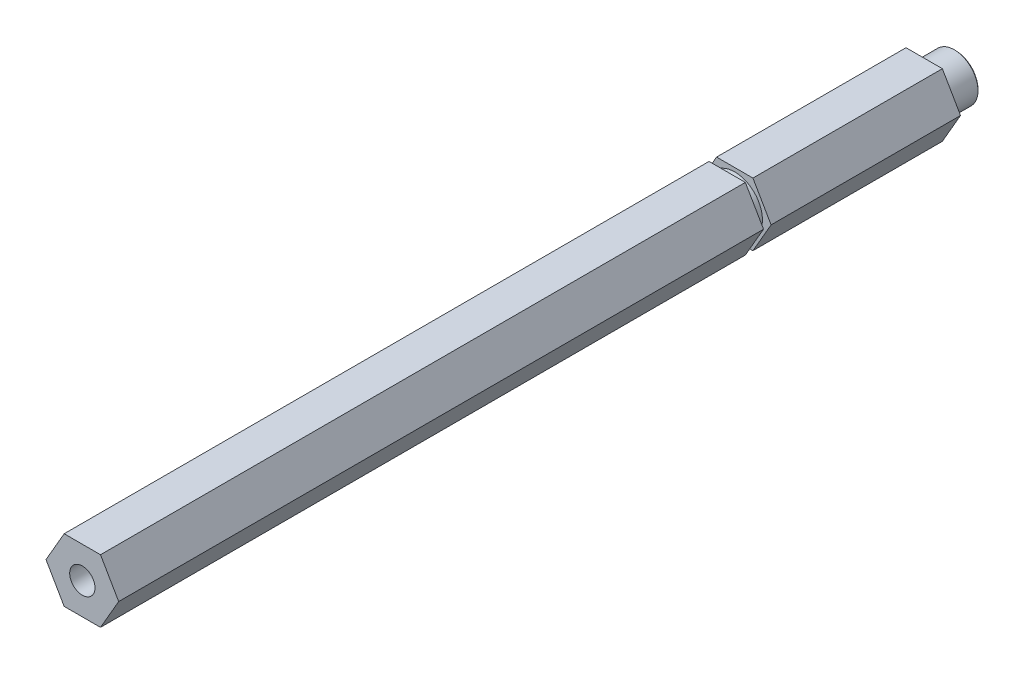
ISO-10303-21;
HEADER;
FILE_DESCRIPTION(('STEP AP214'),'2;1');
FILE_NAME('part.step','',(''),(''),'','','');
FILE_SCHEMA(('AUTOMOTIVE_DESIGN { 1 0 10303 214 1 1 1 1 }'));
ENDSEC;
DATA;
#1=APPLICATION_CONTEXT('core data for automotive mechanical design processes');
#2=APPLICATION_PROTOCOL_DEFINITION('international standard','automotive_design',2000,#1);
#3=PRODUCT_CONTEXT('',#1,'mechanical');
#4=PRODUCT('Part','Part','',(#3));
#5=PRODUCT_RELATED_PRODUCT_CATEGORY('part','',(#4));
#6=PRODUCT_DEFINITION_FORMATION('','',#4);
#7=PRODUCT_DEFINITION_CONTEXT('part definition',#1,'design');
#8=PRODUCT_DEFINITION('design','',#6,#7);
#9=PRODUCT_DEFINITION_SHAPE('','',#8);
#10=(LENGTH_UNIT() NAMED_UNIT(*) SI_UNIT(.MILLI.,.METRE.));
#11=(NAMED_UNIT(*) PLANE_ANGLE_UNIT() SI_UNIT($,.RADIAN.));
#12=(NAMED_UNIT(*) SI_UNIT($,.STERADIAN.) SOLID_ANGLE_UNIT());
#13=UNCERTAINTY_MEASURE_WITH_UNIT(LENGTH_MEASURE(1.E-05),#10,'distance_accuracy_value','');
#14=(GEOMETRIC_REPRESENTATION_CONTEXT(3) GLOBAL_UNCERTAINTY_ASSIGNED_CONTEXT((#13)) GLOBAL_UNIT_ASSIGNED_CONTEXT((#10,
#11,#12)) REPRESENTATION_CONTEXT('',''));
#15=CARTESIAN_POINT('',(0.,0.,0.));
#16=DIRECTION('',(0.,0.,1.));
#17=DIRECTION('',(1.,0.,0.));
#18=AXIS2_PLACEMENT_3D('',#15,#16,#17);
#19=CARTESIAN_POINT('',(0.,0.,11.176));
#20=DIRECTION('',(0.,0.,-1.));
#21=DIRECTION('',(-1.,0.,0.));
#22=AXIS2_PLACEMENT_3D('',#19,#20,#21);
#23=PLANE('',#22);
#24=CARTESIAN_POINT('',(0.,0.,11.176));
#25=DIRECTION('',(0.,0.,-1.));
#26=DIRECTION('',(-1.,0.,0.));
#27=AXIS2_PLACEMENT_3D('',#24,#25,#26);
#28=CIRCLE('',#27,3.175);
#29=CARTESIAN_POINT('',(-3.175,0.,11.176));
#30=VERTEX_POINT('',#29);
#31=EDGE_CURVE('E20',#30,#30,#28,.T.);
#32=ORIENTED_EDGE('',*,*,#31,.T.);
#33=EDGE_LOOP('',(#32));
#34=FACE_BOUND('',#33,.T.);
#35=ADVANCED_FACE('F17',(#34),#23,.T.);
#36=CARTESIAN_POINT('',(0.,0.,11.176));
#37=DIRECTION('',(0.,0.,-1.));
#38=DIRECTION('',(-1.,0.,0.));
#39=AXIS2_PLACEMENT_3D('',#36,#37,#38);
#40=CYLINDRICAL_SURFACE('',#39,3.175);
#41=CARTESIAN_POINT('',(0.,0.,0.253999999983989));
#42=DIRECTION('',(0.,0.,-1.));
#43=DIRECTION('',(-1.,0.,0.));
#44=AXIS2_PLACEMENT_3D('',#41,#42,#43);
#45=CIRCLE('',#44,3.17499999994197);
#46=CARTESIAN_POINT('',(-3.17499999994197,0.,0.253999999983989));
#47=VERTEX_POINT('',#46);
#48=EDGE_CURVE('E139',#47,#47,#45,.T.);
#49=ORIENTED_EDGE('',*,*,#48,.T.);
#50=EDGE_LOOP('',(#49));
#51=FACE_BOUND('',#50,.T.);
#52=ORIENTED_EDGE('',*,*,#31,.F.);
#53=EDGE_LOOP('',(#52));
#54=FACE_BOUND('',#53,.T.);
#55=ADVANCED_FACE('F401',(#51,#54),#40,.F.);
#56=CARTESIAN_POINT('',(0.,0.,1.13686837721616E-10));
#57=DIRECTION('',(0.,0.,-1.));
#58=DIRECTION('',(-1.,0.,0.));
#59=AXIS2_PLACEMENT_3D('',#56,#57,#58);
#60=CONICAL_SURFACE('',#59,3.42899999986912,0.785398163397448);
#61=CARTESIAN_POINT('',(0.,0.,0.));
#62=DIRECTION('',(0.,0.,-1.));
#63=DIRECTION('',(-1.,0.,0.));
#64=AXIS2_PLACEMENT_3D('',#61,#62,#63);
#65=CIRCLE('',#64,3.42899999998281);
#66=CARTESIAN_POINT('',(-3.42899999998281,0.,0.));
#67=VERTEX_POINT('',#66);
#68=EDGE_CURVE('E142',#67,#67,#65,.T.);
#69=ORIENTED_EDGE('',*,*,#68,.T.);
#70=EDGE_LOOP('',(#69));
#71=FACE_BOUND('',#70,.T.);
#72=ORIENTED_EDGE('',*,*,#48,.F.);
#73=EDGE_LOOP('',(#72));
#74=FACE_BOUND('',#73,.T.);
#75=ADVANCED_FACE('F163',(#71,#74),#60,.F.);
#76=CARTESIAN_POINT('',(0.,0.,0.));
#77=DIRECTION('',(0.,0.,1.));
#78=DIRECTION('',(1.,0.,0.));
#79=AXIS2_PLACEMENT_3D('',#76,#77,#78);
#80=PLANE('',#79);
#81=ORIENTED_EDGE('',*,*,#68,.F.);
#82=EDGE_LOOP('',(#81));
#83=FACE_BOUND('',#82,.T.);
#84=CARTESIAN_POINT('',(0.,0.,0.));
#85=DIRECTION('',(0.,0.,1.));
#86=DIRECTION('',(1.,0.,0.));
#87=AXIS2_PLACEMENT_3D('',#84,#85,#86);
#88=CIRCLE('',#87,4.50849999998582);
#89=CARTESIAN_POINT('',(4.50849999998582,0.,0.));
#90=VERTEX_POINT('',#89);
#91=EDGE_CURVE('E138',#90,#90,#88,.T.);
#92=ORIENTED_EDGE('',*,*,#91,.F.);
#93=EDGE_LOOP('',(#92));
#94=FACE_BOUND('',#93,.T.);
#95=ADVANCED_FACE('F166',(#83,#94),#80,.F.);
#96=CARTESIAN_POINT('',(0.,0.,0.253999999927146));
#97=DIRECTION('',(0.,0.,1.));
#98=DIRECTION('',(1.,0.,0.));
#99=AXIS2_PLACEMENT_3D('',#96,#97,#98);
#100=CONICAL_SURFACE('',#99,4.76249999991296,0.785398163397448);
#101=ORIENTED_EDGE('',*,*,#91,.T.);
#102=EDGE_LOOP('',(#101));
#103=FACE_BOUND('',#102,.T.);
#104=CARTESIAN_POINT('',(0.,0.,0.254000000000012));
#105=DIRECTION('',(0.,0.,-1.));
#106=DIRECTION('',(-1.,0.,0.));
#107=AXIS2_PLACEMENT_3D('',#104,#105,#106);
#108=CIRCLE('',#107,4.7625);
#109=CARTESIAN_POINT('',(-4.7625,0.,0.254000000000012));
#110=VERTEX_POINT('',#109);
#111=EDGE_CURVE('E135',#110,#110,#108,.F.);
#112=ORIENTED_EDGE('',*,*,#111,.F.);
#113=EDGE_LOOP('',(#112));
#114=FACE_BOUND('',#113,.T.);
#115=ADVANCED_FACE('F169',(#103,#114),#100,.T.);
#116=CARTESIAN_POINT('',(0.,0.,6.35));
#117=DIRECTION('',(0.,0.,-1.));
#118=DIRECTION('',(-1.,0.,0.));
#119=AXIS2_PLACEMENT_3D('',#116,#117,#118);
#120=CYLINDRICAL_SURFACE('',#119,4.7625);
#121=CARTESIAN_POINT('',(0.,0.,6.35));
#122=DIRECTION('',(0.,0.,-1.));
#123=DIRECTION('',(-1.,0.,0.));
#124=AXIS2_PLACEMENT_3D('',#121,#122,#123);
#125=CIRCLE('',#124,4.7625);
#126=CARTESIAN_POINT('',(-4.7625,0.,6.35));
#127=VERTEX_POINT('',#126);
#128=EDGE_CURVE('E117',#127,#127,#125,.T.);
#129=ORIENTED_EDGE('',*,*,#128,.T.);
#130=EDGE_LOOP('',(#129));
#131=FACE_BOUND('',#130,.T.);
#132=ORIENTED_EDGE('',*,*,#111,.T.);
#133=EDGE_LOOP('',(#132));
#134=FACE_BOUND('',#133,.T.);
#135=ADVANCED_FACE('F175',(#131,#134),#120,.T.);
#136=CARTESIAN_POINT('',(0.,0.,6.35));
#137=DIRECTION('',(0.,0.,1.));
#138=DIRECTION('',(1.,0.,0.));
#139=AXIS2_PLACEMENT_3D('',#136,#137,#138);
#140=PLANE('',#139);
#141=ORIENTED_EDGE('',*,*,#128,.F.);
#142=EDGE_LOOP('',(#141));
#143=FACE_BOUND('',#142,.T.);
#144=DIRECTION('',(-1.,0.,0.));
#145=VECTOR('',#144,1.);
#146=CARTESIAN_POINT('',(-3.66617420935412,-6.35,6.35));
#147=LINE('',#146,#145);
#148=CARTESIAN_POINT('',(3.66617420935412,-6.35,6.35));
#149=VERTEX_POINT('',#148);
#150=CARTESIAN_POINT('',(-3.66617420935412,-6.35,6.35));
#151=VERTEX_POINT('',#150);
#152=EDGE_CURVE('E481',#149,#151,#147,.T.);
#153=ORIENTED_EDGE('',*,*,#152,.T.);
#154=DIRECTION('',(-0.5,0.866025403784438,0.));
#155=VECTOR('',#154,1.);
#156=CARTESIAN_POINT('',(-7.33234841870825,0.,6.35));
#157=LINE('',#156,#155);
#158=CARTESIAN_POINT('',(-7.33234841870825,0.,6.35));
#159=VERTEX_POINT('',#158);
#160=EDGE_CURVE('E491',#151,#159,#157,.T.);
#161=ORIENTED_EDGE('',*,*,#160,.T.);
#162=DIRECTION('',(0.5,0.866025403784439,0.));
#163=VECTOR('',#162,1.);
#164=CARTESIAN_POINT('',(-3.66617420935412,6.35,6.35));
#165=LINE('',#164,#163);
#166=CARTESIAN_POINT('',(-3.66617420935412,6.35,6.35));
#167=VERTEX_POINT('',#166);
#168=EDGE_CURVE('E463',#159,#167,#165,.T.);
#169=ORIENTED_EDGE('',*,*,#168,.T.);
#170=DIRECTION('',(1.,0.,0.));
#171=VECTOR('',#170,1.);
#172=CARTESIAN_POINT('',(3.66617420935412,6.35,6.35));
#173=LINE('',#172,#171);
#174=CARTESIAN_POINT('',(3.66617420935412,6.35,6.35));
#175=VERTEX_POINT('',#174);
#176=EDGE_CURVE('E129',#167,#175,#173,.T.);
#177=ORIENTED_EDGE('',*,*,#176,.T.);
#178=DIRECTION('',(0.5,-0.866025403784439,0.));
#179=VECTOR('',#178,1.);
#180=CARTESIAN_POINT('',(7.33234841870825,0.,6.34999999999999));
#181=LINE('',#180,#179);
#182=CARTESIAN_POINT('',(7.33234841870825,0.,6.35));
#183=VERTEX_POINT('',#182);
#184=EDGE_CURVE('E122',#175,#183,#181,.T.);
#185=ORIENTED_EDGE('',*,*,#184,.T.);
#186=DIRECTION('',(-0.5,-0.866025403784439,0.));
#187=VECTOR('',#186,1.);
#188=CARTESIAN_POINT('',(3.66617420935412,-6.35,6.35));
#189=LINE('',#188,#187);
#190=EDGE_CURVE('E106',#183,#149,#189,.T.);
#191=ORIENTED_EDGE('',*,*,#190,.T.);
#192=EDGE_LOOP('',(#153,#161,#169,#177,#185,#191));
#193=FACE_BOUND('',#192,.T.);
#194=ADVANCED_FACE('F127',(#143,#193),#140,.F.);
#195=CARTESIAN_POINT('',(3.66617420935412,-6.35,44.577));
#196=DIRECTION('',(-0.866025403784439,0.5,0.));
#197=DIRECTION('',(-0.5,-0.866025403784439,0.));
#198=AXIS2_PLACEMENT_3D('',#195,#196,#197);
#199=PLANE('',#198);
#200=DIRECTION('',(0.,0.,1.));
#201=VECTOR('',#200,1.);
#202=CARTESIAN_POINT('',(7.33234841870825,0.,44.577));
#203=LINE('',#202,#201);
#204=CARTESIAN_POINT('',(7.33234841870825,0.,44.577));
#205=VERTEX_POINT('',#204);
#206=EDGE_CURVE('E110',#183,#205,#203,.T.);
#207=ORIENTED_EDGE('',*,*,#206,.T.);
#208=DIRECTION('',(0.5,0.866025403784439,0.));
#209=VECTOR('',#208,1.);
#210=CARTESIAN_POINT('',(3.66617420935412,-6.35,44.577));
#211=LINE('',#210,#209);
#212=CARTESIAN_POINT('',(3.66617420935412,-6.35,44.577));
#213=VERTEX_POINT('',#212);
#214=EDGE_CURVE('E479',#213,#205,#211,.T.);
#215=ORIENTED_EDGE('',*,*,#214,.F.);
#216=DIRECTION('',(0.,0.,1.));
#217=VECTOR('',#216,1.);
#218=CARTESIAN_POINT('',(3.66617420935412,-6.35,44.577));
#219=LINE('',#218,#217);
#220=EDGE_CURVE('E112',#213,#149,#219,.F.);
#221=ORIENTED_EDGE('',*,*,#220,.T.);
#222=ORIENTED_EDGE('',*,*,#190,.F.);
#223=EDGE_LOOP('',(#207,#215,#221,#222));
#224=FACE_BOUND('',#223,.T.);
#225=ADVANCED_FACE('F108',(#224),#199,.F.);
#226=CARTESIAN_POINT('',(7.33234841870825,0.,44.577));
#227=DIRECTION('',(-0.866025403784439,-0.5,0.));
#228=DIRECTION('',(0.5,-0.866025403784439,0.));
#229=AXIS2_PLACEMENT_3D('',#226,#227,#228);
#230=PLANE('',#229);
#231=DIRECTION('',(0.,0.,-1.));
#232=VECTOR('',#231,1.);
#233=CARTESIAN_POINT('',(3.66617420935412,6.35,44.577));
#234=LINE('',#233,#232);
#235=CARTESIAN_POINT('',(3.66617420935412,6.35,44.577));
#236=VERTEX_POINT('',#235);
#237=EDGE_CURVE('E130',#175,#236,#234,.F.);
#238=ORIENTED_EDGE('',*,*,#237,.T.);
#239=DIRECTION('',(-0.5,0.866025403784438,0.));
#240=VECTOR('',#239,1.);
#241=CARTESIAN_POINT('',(7.33234841870825,0.,44.577));
#242=LINE('',#241,#240);
#243=EDGE_CURVE('E124',#205,#236,#242,.T.);
#244=ORIENTED_EDGE('',*,*,#243,.F.);
#245=ORIENTED_EDGE('',*,*,#206,.F.);
#246=ORIENTED_EDGE('',*,*,#184,.F.);
#247=EDGE_LOOP('',(#238,#244,#245,#246));
#248=FACE_BOUND('',#247,.T.);
#249=ADVANCED_FACE('F121',(#248),#230,.F.);
#250=CARTESIAN_POINT('',(3.66617420935412,6.35,44.577));
#251=DIRECTION('',(0.,-1.,0.));
#252=DIRECTION('',(0.,0.,-1.));
#253=AXIS2_PLACEMENT_3D('',#250,#251,#252);
#254=PLANE('',#253);
#255=DIRECTION('',(0.,0.,1.));
#256=VECTOR('',#255,1.);
#257=CARTESIAN_POINT('',(-3.66617420935412,6.35,44.577));
#258=LINE('',#257,#256);
#259=CARTESIAN_POINT('',(-3.66617420935412,6.35,44.577));
#260=VERTEX_POINT('',#259);
#261=EDGE_CURVE('E460',#167,#260,#258,.T.);
#262=ORIENTED_EDGE('',*,*,#261,.T.);
#263=DIRECTION('',(1.,0.,0.));
#264=VECTOR('',#263,1.);
#265=CARTESIAN_POINT('',(0.,6.35,44.577));
#266=LINE('',#265,#264);
#267=EDGE_CURVE('E462',#236,#260,#266,.F.);
#268=ORIENTED_EDGE('',*,*,#267,.F.);
#269=ORIENTED_EDGE('',*,*,#237,.F.);
#270=ORIENTED_EDGE('',*,*,#176,.F.);
#271=EDGE_LOOP('',(#262,#268,#269,#270));
#272=FACE_BOUND('',#271,.T.);
#273=ADVANCED_FACE('F251',(#272),#254,.F.);
#274=CARTESIAN_POINT('',(-3.66617420935412,6.35,44.577));
#275=DIRECTION('',(0.866025403784439,-0.5,0.));
#276=DIRECTION('',(0.5,0.866025403784439,0.));
#277=AXIS2_PLACEMENT_3D('',#274,#275,#276);
#278=PLANE('',#277);
#279=DIRECTION('',(0.,0.,1.));
#280=VECTOR('',#279,1.);
#281=CARTESIAN_POINT('',(-7.33234841870825,0.,44.577));
#282=LINE('',#281,#280);
#283=CARTESIAN_POINT('',(-7.33234841870825,0.,44.577));
#284=VERTEX_POINT('',#283);
#285=EDGE_CURVE('E468',#159,#284,#282,.T.);
#286=ORIENTED_EDGE('',*,*,#285,.T.);
#287=DIRECTION('',(-0.5,-0.866025403784438,0.));
#288=VECTOR('',#287,1.);
#289=CARTESIAN_POINT('',(-3.66617420935412,6.35,44.577));
#290=LINE('',#289,#288);
#291=EDGE_CURVE('E466',#260,#284,#290,.T.);
#292=ORIENTED_EDGE('',*,*,#291,.F.);
#293=ORIENTED_EDGE('',*,*,#261,.F.);
#294=ORIENTED_EDGE('',*,*,#168,.F.);
#295=EDGE_LOOP('',(#286,#292,#293,#294));
#296=FACE_BOUND('',#295,.T.);
#297=ADVANCED_FACE('F247',(#296),#278,.F.);
#298=CARTESIAN_POINT('',(-7.33234841870825,0.,44.577));
#299=DIRECTION('',(0.866025403784438,0.5,0.));
#300=DIRECTION('',(-0.5,0.866025403784438,0.));
#301=AXIS2_PLACEMENT_3D('',#298,#299,#300);
#302=PLANE('',#301);
#303=DIRECTION('',(0.,0.,1.));
#304=VECTOR('',#303,1.);
#305=CARTESIAN_POINT('',(-3.66617420935412,-6.35,44.577));
#306=LINE('',#305,#304);
#307=CARTESIAN_POINT('',(-3.66617420935412,-6.35,44.577));
#308=VERTEX_POINT('',#307);
#309=EDGE_CURVE('E488',#151,#308,#306,.T.);
#310=ORIENTED_EDGE('',*,*,#309,.T.);
#311=DIRECTION('',(0.5,-0.866025403784438,0.));
#312=VECTOR('',#311,1.);
#313=CARTESIAN_POINT('',(-7.33234841870825,0.,44.577));
#314=LINE('',#313,#312);
#315=EDGE_CURVE('E471',#284,#308,#314,.T.);
#316=ORIENTED_EDGE('',*,*,#315,.F.);
#317=ORIENTED_EDGE('',*,*,#285,.F.);
#318=ORIENTED_EDGE('',*,*,#160,.F.);
#319=EDGE_LOOP('',(#310,#316,#317,#318));
#320=FACE_BOUND('',#319,.T.);
#321=ADVANCED_FACE('F243',(#320),#302,.F.);
#322=CARTESIAN_POINT('',(-3.66617420935412,-6.35,44.577));
#323=DIRECTION('',(0.,1.,0.));
#324=DIRECTION('',(-1.,0.,0.));
#325=AXIS2_PLACEMENT_3D('',#322,#323,#324);
#326=PLANE('',#325);
#327=ORIENTED_EDGE('',*,*,#220,.F.);
#328=DIRECTION('',(1.,0.,0.));
#329=VECTOR('',#328,1.);
#330=CARTESIAN_POINT('',(0.,-6.35,44.577));
#331=LINE('',#330,#329);
#332=EDGE_CURVE('E473',#308,#213,#331,.T.);
#333=ORIENTED_EDGE('',*,*,#332,.F.);
#334=ORIENTED_EDGE('',*,*,#309,.F.);
#335=ORIENTED_EDGE('',*,*,#152,.F.);
#336=EDGE_LOOP('',(#327,#333,#334,#335));
#337=FACE_BOUND('',#336,.T.);
#338=ADVANCED_FACE('F239',(#337),#326,.F.);
#339=CARTESIAN_POINT('',(0.,0.,159.717739999962));
#340=DIRECTION('',(0.,0.,1.));
#341=DIRECTION('',(1.,0.,0.));
#342=AXIS2_PLACEMENT_3D('',#339,#340,#341);
#343=CONICAL_SURFACE('',#342,2.55269999991015,1.02974425853382);
#344=CARTESIAN_POINT('',(-1.70530256582424E-10,0.,158.183923097738));
#345=VERTEX_POINT('',#344);
#346=VERTEX_LOOP('',#345);
#347=FACE_BOUND('',#346,.T.);
#348=CARTESIAN_POINT('',(0.,0.,159.71774));
#349=DIRECTION('',(0.,0.,1.));
#350=DIRECTION('',(1.,0.,0.));
#351=AXIS2_PLACEMENT_3D('',#348,#349,#350);
#352=CIRCLE('',#351,2.55269999999999);
#353=CARTESIAN_POINT('',(2.55269999999999,0.,159.71774));
#354=VERTEX_POINT('',#353);
#355=EDGE_CURVE('E482',#354,#354,#352,.T.);
#356=ORIENTED_EDGE('',*,*,#355,.T.);
#357=EDGE_LOOP('',(#356));
#358=FACE_BOUND('',#357,.T.);
#359=ADVANCED_FACE('F235',(#347,#358),#343,.F.);
#360=CARTESIAN_POINT('',(0.,0.,44.577));
#361=DIRECTION('',(0.,0.,1.));
#362=DIRECTION('',(1.,0.,0.));
#363=AXIS2_PLACEMENT_3D('',#360,#361,#362);
#364=PLANE('',#363);
#365=CARTESIAN_POINT('',(0.,0.,44.577));
#366=DIRECTION('',(0.,0.,-1.));
#367=DIRECTION('',(-1.,0.,0.));
#368=AXIS2_PLACEMENT_3D('',#365,#366,#367);
#369=CIRCLE('',#368,5.588);
#370=CARTESIAN_POINT('',(-5.588,0.,44.577));
#371=VERTEX_POINT('',#370);
#372=EDGE_CURVE('E153',#371,#371,#369,.F.);
#373=ORIENTED_EDGE('',*,*,#372,.F.);
#374=EDGE_LOOP('',(#373));
#375=FACE_BOUND('',#374,.T.);
#376=ORIENTED_EDGE('',*,*,#315,.T.);
#377=ORIENTED_EDGE('',*,*,#332,.T.);
#378=ORIENTED_EDGE('',*,*,#214,.T.);
#379=ORIENTED_EDGE('',*,*,#243,.T.);
#380=ORIENTED_EDGE('',*,*,#267,.T.);
#381=ORIENTED_EDGE('',*,*,#291,.T.);
#382=EDGE_LOOP('',(#376,#377,#378,#379,#380,#381));
#383=FACE_BOUND('',#382,.T.);
#384=ADVANCED_FACE('F231',(#375,#383),#364,.T.);
#385=CARTESIAN_POINT('',(0.,0.,176.22774));
#386=DIRECTION('',(0.,0.,1.));
#387=DIRECTION('',(1.,0.,0.));
#388=AXIS2_PLACEMENT_3D('',#385,#386,#387);
#389=CYLINDRICAL_SURFACE('',#388,2.55269999999999);
#390=CARTESIAN_POINT('',(0.,0.,176.22774));
#391=DIRECTION('',(0.,0.,1.));
#392=DIRECTION('',(1.,0.,0.));
#393=AXIS2_PLACEMENT_3D('',#390,#391,#392);
#394=CIRCLE('',#393,2.55269999999999);
#395=CARTESIAN_POINT('',(2.55269999999999,0.,176.22774));
#396=VERTEX_POINT('',#395);
#397=EDGE_CURVE('E148',#396,#396,#394,.F.);
#398=ORIENTED_EDGE('',*,*,#397,.F.);
#399=EDGE_LOOP('',(#398));
#400=FACE_BOUND('',#399,.T.);
#401=ORIENTED_EDGE('',*,*,#355,.F.);
#402=EDGE_LOOP('',(#401));
#403=FACE_BOUND('',#402,.T.);
#404=ADVANCED_FACE('F227',(#400,#403),#389,.F.);
#405=CARTESIAN_POINT('',(-7.33234841870824,0.,176.22774));
#406=DIRECTION('',(0.866025403784438,0.5,0.));
#407=DIRECTION('',(-0.5,0.866025403784438,0.));
#408=AXIS2_PLACEMENT_3D('',#405,#406,#407);
#409=PLANE('',#408);
#410=DIRECTION('',(0.,0.,1.));
#411=VECTOR('',#410,1.);
#412=CARTESIAN_POINT('',(-3.66617420935412,-6.35,176.22774));
#413=LINE('',#412,#411);
#414=CARTESIAN_POINT('',(-3.66617420935412,-6.35,46.101));
#415=VERTEX_POINT('',#414);
#416=CARTESIAN_POINT('',(-3.66617420935412,-6.35,176.22774));
#417=VERTEX_POINT('',#416);
#418=EDGE_CURVE('E485',#415,#417,#413,.T.);
#419=ORIENTED_EDGE('',*,*,#418,.T.);
#420=DIRECTION('',(0.5,-0.866025403784439,0.));
#421=VECTOR('',#420,1.);
#422=CARTESIAN_POINT('',(-7.33234841870824,0.,176.22774));
#423=LINE('',#422,#421);
#424=CARTESIAN_POINT('',(-7.33234841870825,0.,176.22774));
#425=VERTEX_POINT('',#424);
#426=EDGE_CURVE('E507',#425,#417,#423,.T.);
#427=ORIENTED_EDGE('',*,*,#426,.F.);
#428=DIRECTION('',(0.,0.,1.));
#429=VECTOR('',#428,1.);
#430=CARTESIAN_POINT('',(-7.33234841870825,0.,176.22774));
#431=LINE('',#430,#429);
#432=CARTESIAN_POINT('',(-7.33234841870825,0.,46.101));
#433=VERTEX_POINT('',#432);
#434=EDGE_CURVE('E515',#425,#433,#431,.F.);
#435=ORIENTED_EDGE('',*,*,#434,.T.);
#436=DIRECTION('',(0.5,-0.866025403784439,0.));
#437=VECTOR('',#436,1.);
#438=CARTESIAN_POINT('',(-7.33234841870824,0.,46.101));
#439=LINE('',#438,#437);
#440=EDGE_CURVE('E521',#433,#415,#439,.T.);
#441=ORIENTED_EDGE('',*,*,#440,.T.);
#442=EDGE_LOOP('',(#419,#427,#435,#441));
#443=FACE_BOUND('',#442,.T.);
#444=ADVANCED_FACE('F223',(#443),#409,.F.);
#445=CARTESIAN_POINT('',(-3.66617420935412,-6.35,176.22774));
#446=DIRECTION('',(0.,1.,0.));
#447=DIRECTION('',(-1.,0.,0.));
#448=AXIS2_PLACEMENT_3D('',#445,#446,#447);
#449=PLANE('',#448);
#450=DIRECTION('',(0.,0.,1.));
#451=VECTOR('',#450,1.);
#452=CARTESIAN_POINT('',(3.66617420935413,-6.35,176.22774));
#453=LINE('',#452,#451);
#454=CARTESIAN_POINT('',(3.66617420935413,-6.35,46.101));
#455=VERTEX_POINT('',#454);
#456=CARTESIAN_POINT('',(3.66617420935413,-6.35,176.22774));
#457=VERTEX_POINT('',#456);
#458=EDGE_CURVE('E156',#455,#457,#453,.T.);
#459=ORIENTED_EDGE('',*,*,#458,.T.);
#460=DIRECTION('',(1.,0.,0.));
#461=VECTOR('',#460,1.);
#462=CARTESIAN_POINT('',(0.,-6.35,176.22774));
#463=LINE('',#462,#461);
#464=EDGE_CURVE('E509',#417,#457,#463,.T.);
#465=ORIENTED_EDGE('',*,*,#464,.F.);
#466=ORIENTED_EDGE('',*,*,#418,.F.);
#467=DIRECTION('',(1.,0.,0.));
#468=VECTOR('',#467,1.);
#469=CARTESIAN_POINT('',(0.,-6.35,46.101));
#470=LINE('',#469,#468);
#471=EDGE_CURVE('E524',#415,#455,#470,.T.);
#472=ORIENTED_EDGE('',*,*,#471,.T.);
#473=EDGE_LOOP('',(#459,#465,#466,#472));
#474=FACE_BOUND('',#473,.T.);
#475=ADVANCED_FACE('F219',(#474),#449,.F.);
#476=CARTESIAN_POINT('',(3.66617420935413,-6.35,176.22774));
#477=DIRECTION('',(-0.866025403784439,0.499999999999999,0.));
#478=DIRECTION('',(-0.499999999999999,-0.866025403784439,0.));
#479=AXIS2_PLACEMENT_3D('',#476,#477,#478);
#480=PLANE('',#479);
#481=DIRECTION('',(0.,0.,1.));
#482=VECTOR('',#481,1.);
#483=CARTESIAN_POINT('',(7.33234841870824,0.,176.22774));
#484=LINE('',#483,#482);
#485=CARTESIAN_POINT('',(7.33234841870824,0.,46.101));
#486=VERTEX_POINT('',#485);
#487=CARTESIAN_POINT('',(7.33234841870824,0.,176.22774));
#488=VERTEX_POINT('',#487);
#489=EDGE_CURVE('E152',#486,#488,#484,.T.);
#490=ORIENTED_EDGE('',*,*,#489,.T.);
#491=DIRECTION('',(0.499999999999999,0.866025403784439,0.));
#492=VECTOR('',#491,1.);
#493=CARTESIAN_POINT('',(3.66617420935413,-6.35,176.22774));
#494=LINE('',#493,#492);
#495=EDGE_CURVE('E151',#457,#488,#494,.T.);
#496=ORIENTED_EDGE('',*,*,#495,.F.);
#497=ORIENTED_EDGE('',*,*,#458,.F.);
#498=DIRECTION('',(0.499999999999999,0.866025403784439,0.));
#499=VECTOR('',#498,1.);
#500=CARTESIAN_POINT('',(3.66617420935413,-6.35,46.101));
#501=LINE('',#500,#499);
#502=EDGE_CURVE('E147',#455,#486,#501,.T.);
#503=ORIENTED_EDGE('',*,*,#502,.T.);
#504=EDGE_LOOP('',(#490,#496,#497,#503));
#505=FACE_BOUND('',#504,.T.);
#506=ADVANCED_FACE('F215',(#505),#480,.F.);
#507=CARTESIAN_POINT('',(0.,0.,46.101));
#508=DIRECTION('',(0.,0.,-1.));
#509=DIRECTION('',(-1.,0.,0.));
#510=AXIS2_PLACEMENT_3D('',#507,#508,#509);
#511=CYLINDRICAL_SURFACE('',#510,5.588);
#512=CARTESIAN_POINT('',(0.,0.,46.101));
#513=DIRECTION('',(0.,0.,-1.));
#514=DIRECTION('',(-1.,0.,0.));
#515=AXIS2_PLACEMENT_3D('',#512,#513,#514);
#516=CIRCLE('',#515,5.588);
#517=CARTESIAN_POINT('',(-5.588,0.,46.101));
#518=VERTEX_POINT('',#517);
#519=EDGE_CURVE('E143',#518,#518,#516,.T.);
#520=ORIENTED_EDGE('',*,*,#519,.T.);
#521=EDGE_LOOP('',(#520));
#522=FACE_BOUND('',#521,.T.);
#523=ORIENTED_EDGE('',*,*,#372,.T.);
#524=EDGE_LOOP('',(#523));
#525=FACE_BOUND('',#524,.T.);
#526=ADVANCED_FACE('F211',(#522,#525),#511,.T.);
#527=CARTESIAN_POINT('',(7.33234841870824,0.,176.22774));
#528=DIRECTION('',(-0.866025403784439,-0.5,0.));
#529=DIRECTION('',(0.5,-0.866025403784439,0.));
#530=AXIS2_PLACEMENT_3D('',#527,#528,#529);
#531=PLANE('',#530);
#532=DIRECTION('',(0.,0.,1.));
#533=VECTOR('',#532,1.);
#534=CARTESIAN_POINT('',(3.66617420935412,6.35,176.22774));
#535=LINE('',#534,#533);
#536=CARTESIAN_POINT('',(3.66617420935412,6.35,46.101));
#537=VERTEX_POINT('',#536);
#538=CARTESIAN_POINT('',(3.66617420935412,6.35,176.22774));
#539=VERTEX_POINT('',#538);
#540=EDGE_CURVE('E146',#537,#539,#535,.T.);
#541=ORIENTED_EDGE('',*,*,#540,.T.);
#542=DIRECTION('',(-0.5,0.866025403784439,0.));
#543=VECTOR('',#542,1.);
#544=CARTESIAN_POINT('',(7.33234841870824,0.,176.22774));
#545=LINE('',#544,#543);
#546=EDGE_CURVE('E505',#488,#539,#545,.T.);
#547=ORIENTED_EDGE('',*,*,#546,.F.);
#548=ORIENTED_EDGE('',*,*,#489,.F.);
#549=DIRECTION('',(-0.5,0.866025403784439,0.));
#550=VECTOR('',#549,1.);
#551=CARTESIAN_POINT('',(7.33234841870824,0.,46.101));
#552=LINE('',#551,#550);
#553=EDGE_CURVE('E517',#486,#537,#552,.T.);
#554=ORIENTED_EDGE('',*,*,#553,.T.);
#555=EDGE_LOOP('',(#541,#547,#548,#554));
#556=FACE_BOUND('',#555,.T.);
#557=ADVANCED_FACE('F207',(#556),#531,.F.);
#558=CARTESIAN_POINT('',(0.,0.,176.22774));
#559=DIRECTION('',(0.,0.,1.));
#560=DIRECTION('',(1.,0.,0.));
#561=AXIS2_PLACEMENT_3D('',#558,#559,#560);
#562=PLANE('',#561);
#563=ORIENTED_EDGE('',*,*,#426,.T.);
#564=ORIENTED_EDGE('',*,*,#464,.T.);
#565=ORIENTED_EDGE('',*,*,#495,.T.);
#566=ORIENTED_EDGE('',*,*,#546,.T.);
#567=DIRECTION('',(1.,0.,0.));
#568=VECTOR('',#567,1.);
#569=CARTESIAN_POINT('',(3.66617420935412,6.35,176.22774));
#570=LINE('',#569,#568);
#571=CARTESIAN_POINT('',(-3.66617420935413,6.35,176.22774));
#572=VERTEX_POINT('',#571);
#573=EDGE_CURVE('E531',#539,#572,#570,.F.);
#574=ORIENTED_EDGE('',*,*,#573,.T.);
#575=DIRECTION('',(0.499999999999999,0.866025403784439,0.));
#576=VECTOR('',#575,1.);
#577=CARTESIAN_POINT('',(-3.66617420935413,6.35,176.22774));
#578=LINE('',#577,#576);
#579=EDGE_CURVE('E512',#572,#425,#578,.F.);
#580=ORIENTED_EDGE('',*,*,#579,.T.);
#581=EDGE_LOOP('',(#563,#564,#565,#566,#574,#580));
#582=FACE_BOUND('',#581,.T.);
#583=ORIENTED_EDGE('',*,*,#397,.T.);
#584=EDGE_LOOP('',(#583));
#585=FACE_BOUND('',#584,.T.);
#586=ADVANCED_FACE('F203',(#582,#585),#562,.T.);
#587=CARTESIAN_POINT('',(-3.66617420935413,6.35,176.22774));
#588=DIRECTION('',(0.866025403784439,-0.499999999999999,0.));
#589=DIRECTION('',(0.499999999999999,0.866025403784439,0.));
#590=AXIS2_PLACEMENT_3D('',#587,#588,#589);
#591=PLANE('',#590);
#592=ORIENTED_EDGE('',*,*,#434,.F.);
#593=ORIENTED_EDGE('',*,*,#579,.F.);
#594=DIRECTION('',(0.,0.,1.));
#595=VECTOR('',#594,1.);
#596=CARTESIAN_POINT('',(-3.66617420935413,6.35,176.22774));
#597=LINE('',#596,#595);
#598=CARTESIAN_POINT('',(-3.66617420935413,6.35,46.101));
#599=VERTEX_POINT('',#598);
#600=EDGE_CURVE('E26',#572,#599,#597,.F.);
#601=ORIENTED_EDGE('',*,*,#600,.T.);
#602=DIRECTION('',(-0.499999999999999,-0.866025403784439,0.));
#603=VECTOR('',#602,1.);
#604=CARTESIAN_POINT('',(-3.66617420935413,6.35,46.101));
#605=LINE('',#604,#603);
#606=EDGE_CURVE('E34',#599,#433,#605,.T.);
#607=ORIENTED_EDGE('',*,*,#606,.T.);
#608=EDGE_LOOP('',(#592,#593,#601,#607));
#609=FACE_BOUND('',#608,.T.);
#610=ADVANCED_FACE('F196',(#609),#591,.F.);
#611=CARTESIAN_POINT('',(0.,0.,46.101));
#612=DIRECTION('',(0.,0.,1.));
#613=DIRECTION('',(1.,0.,0.));
#614=AXIS2_PLACEMENT_3D('',#611,#612,#613);
#615=PLANE('',#614);
#616=ORIENTED_EDGE('',*,*,#519,.F.);
#617=EDGE_LOOP('',(#616));
#618=FACE_BOUND('',#617,.T.);
#619=ORIENTED_EDGE('',*,*,#471,.F.);
#620=ORIENTED_EDGE('',*,*,#440,.F.);
#621=ORIENTED_EDGE('',*,*,#606,.F.);
#622=DIRECTION('',(1.,0.,0.));
#623=VECTOR('',#622,1.);
#624=CARTESIAN_POINT('',(3.66617420935412,6.35,46.101));
#625=LINE('',#624,#623);
#626=EDGE_CURVE('E11',#599,#537,#625,.T.);
#627=ORIENTED_EDGE('',*,*,#626,.T.);
#628=ORIENTED_EDGE('',*,*,#553,.F.);
#629=ORIENTED_EDGE('',*,*,#502,.F.);
#630=EDGE_LOOP('',(#619,#620,#621,#627,#628,#629));
#631=FACE_BOUND('',#630,.T.);
#632=ADVANCED_FACE('F190',(#618,#631),#615,.F.);
#633=CARTESIAN_POINT('',(3.66617420935412,6.35,176.22774));
#634=DIRECTION('',(0.,-1.,0.));
#635=DIRECTION('',(1.,0.,0.));
#636=AXIS2_PLACEMENT_3D('',#633,#634,#635);
#637=PLANE('',#636);
#638=ORIENTED_EDGE('',*,*,#600,.F.);
#639=ORIENTED_EDGE('',*,*,#573,.F.);
#640=ORIENTED_EDGE('',*,*,#540,.F.);
#641=ORIENTED_EDGE('',*,*,#626,.F.);
#642=EDGE_LOOP('',(#638,#639,#640,#641));
#643=FACE_BOUND('',#642,.T.);
#644=ADVANCED_FACE('F188',(#643),#637,.F.);
#645=CLOSED_SHELL('',(#35,#55,#75,#95,#115,#135,#194,#225,#249,#273,#297,#321,#338,#359,#384,
#404,#444,#475,#506,#526,#557,#586,#610,#632,#644));
#646=MANIFOLD_SOLID_BREP('B1',#645);
#647=ADVANCED_BREP_SHAPE_REPRESENTATION('',(#18,#646),#14);
#648=SHAPE_DEFINITION_REPRESENTATION(#9,#647);
ENDSEC;
END-ISO-10303-21;
